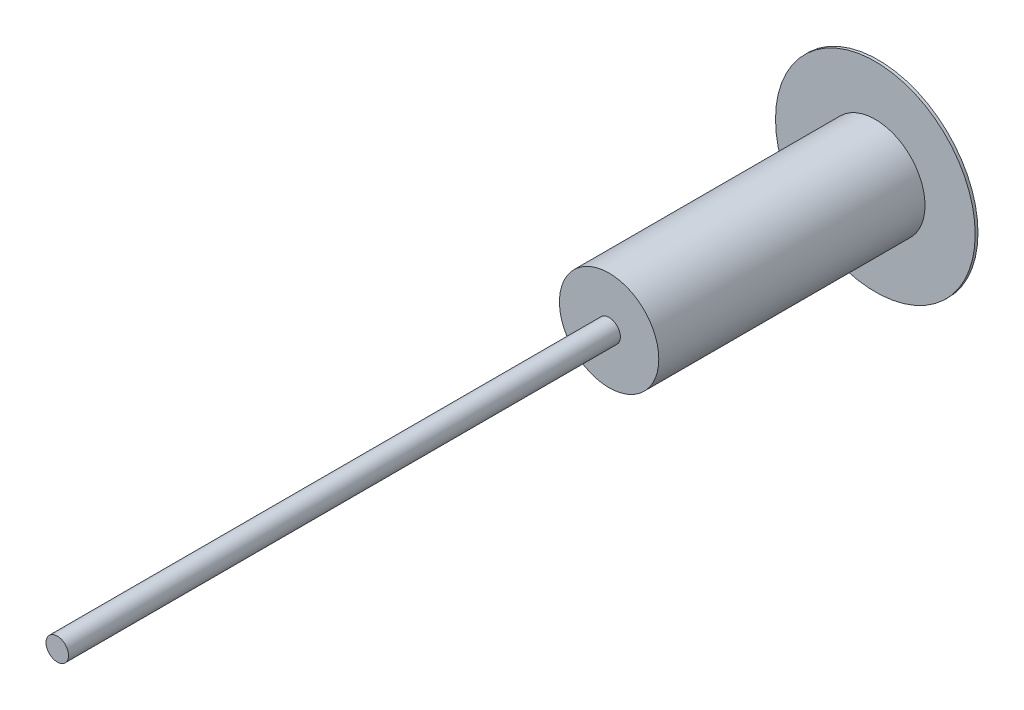
ISO-10303-21;
HEADER;
FILE_DESCRIPTION(('STEP AP214'),'2;1');
FILE_NAME('part.step','',(''),(''),'','','');
FILE_SCHEMA(('AUTOMOTIVE_DESIGN { 1 0 10303 214 1 1 1 1 }'));
ENDSEC;
DATA;
#1=APPLICATION_CONTEXT('core data for automotive mechanical design processes');
#2=APPLICATION_PROTOCOL_DEFINITION('international standard','automotive_design',2000,#1);
#3=PRODUCT_CONTEXT('',#1,'mechanical');
#4=PRODUCT('Part','Part','',(#3));
#5=PRODUCT_RELATED_PRODUCT_CATEGORY('part','',(#4));
#6=PRODUCT_DEFINITION_FORMATION('','',#4);
#7=PRODUCT_DEFINITION_CONTEXT('part definition',#1,'design');
#8=PRODUCT_DEFINITION('design','',#6,#7);
#9=PRODUCT_DEFINITION_SHAPE('','',#8);
#10=(LENGTH_UNIT() NAMED_UNIT(*) SI_UNIT(.MILLI.,.METRE.));
#11=(NAMED_UNIT(*) PLANE_ANGLE_UNIT() SI_UNIT($,.RADIAN.));
#12=(NAMED_UNIT(*) SI_UNIT($,.STERADIAN.) SOLID_ANGLE_UNIT());
#13=UNCERTAINTY_MEASURE_WITH_UNIT(LENGTH_MEASURE(1.E-05),#10,'distance_accuracy_value','');
#14=(GEOMETRIC_REPRESENTATION_CONTEXT(3) GLOBAL_UNCERTAINTY_ASSIGNED_CONTEXT((#13)) GLOBAL_UNIT_ASSIGNED_CONTEXT((#10,
#11,#12)) REPRESENTATION_CONTEXT('',''));
#15=CARTESIAN_POINT('',(0.,0.,0.));
#16=DIRECTION('',(0.,0.,1.));
#17=DIRECTION('',(1.,0.,0.));
#18=AXIS2_PLACEMENT_3D('',#15,#16,#17);
#19=CARTESIAN_POINT('',(0.,0.,-2037.3));
#20=DIRECTION('',(0.,0.,-1.));
#21=DIRECTION('',(-1.,0.,0.));
#22=AXIS2_PLACEMENT_3D('',#19,#20,#21);
#23=CYLINDRICAL_SURFACE('',#22,450.);
#24=CARTESIAN_POINT('',(0.,0.,-2037.3));
#25=DIRECTION('',(0.,0.,1.));
#26=DIRECTION('',(1.,0.,0.));
#27=AXIS2_PLACEMENT_3D('',#24,#25,#26);
#28=CIRCLE('',#27,450.);
#29=CARTESIAN_POINT('',(450.,0.,-2037.3));
#30=VERTEX_POINT('',#29);
#31=EDGE_CURVE('E44',#30,#30,#28,.T.);
#32=ORIENTED_EDGE('',*,*,#31,.F.);
#33=EDGE_LOOP('',(#32));
#34=FACE_BOUND('',#33,.T.);
#35=CARTESIAN_POINT('',(0.,0.,-2050.));
#36=DIRECTION('',(0.,0.,1.));
#37=DIRECTION('',(1.,0.,0.));
#38=AXIS2_PLACEMENT_3D('',#35,#36,#37);
#39=CIRCLE('',#38,450.);
#40=CARTESIAN_POINT('',(450.,0.,-2050.));
#41=VERTEX_POINT('',#40);
#42=EDGE_CURVE('E48',#41,#41,#39,.T.);
#43=ORIENTED_EDGE('',*,*,#42,.T.);
#44=EDGE_LOOP('',(#43));
#45=FACE_BOUND('',#44,.T.);
#46=ADVANCED_FACE('F36',(#34,#45),#23,.T.);
#47=CARTESIAN_POINT('',(0.,0.,-2037.3));
#48=DIRECTION('',(0.,0.,1.));
#49=DIRECTION('',(1.,0.,0.));
#50=AXIS2_PLACEMENT_3D('',#47,#48,#49);
#51=PLANE('',#50);
#52=CARTESIAN_POINT('',(0.,0.,-2037.3));
#53=DIRECTION('',(0.,0.,1.));
#54=DIRECTION('',(1.,0.,0.));
#55=AXIS2_PLACEMENT_3D('',#52,#53,#54);
#56=CIRCLE('',#55,223.901);
#57=CARTESIAN_POINT('',(223.901,0.,-2037.3));
#58=VERTEX_POINT('',#57);
#59=EDGE_CURVE('E53',#58,#58,#56,.T.);
#60=ORIENTED_EDGE('',*,*,#59,.F.);
#61=EDGE_LOOP('',(#60));
#62=FACE_BOUND('',#61,.T.);
#63=ORIENTED_EDGE('',*,*,#31,.T.);
#64=EDGE_LOOP('',(#63));
#65=FACE_BOUND('',#64,.T.);
#66=ADVANCED_FACE('F78',(#62,#65),#51,.T.);
#67=CARTESIAN_POINT('',(0.,0.,-2050.));
#68=DIRECTION('',(0.,0.,1.));
#69=DIRECTION('',(1.,0.,0.));
#70=AXIS2_PLACEMENT_3D('',#67,#68,#69);
#71=PLANE('',#70);
#72=ORIENTED_EDGE('',*,*,#42,.F.);
#73=EDGE_LOOP('',(#72));
#74=FACE_BOUND('',#73,.T.);
#75=ADVANCED_FACE('F74',(#74),#71,.F.);
#76=CARTESIAN_POINT('',(0.,0.,-837.3));
#77=DIRECTION('',(0.,0.,-1.));
#78=DIRECTION('',(-1.,0.,0.));
#79=AXIS2_PLACEMENT_3D('',#76,#77,#78);
#80=CYLINDRICAL_SURFACE('',#79,223.901);
#81=CARTESIAN_POINT('',(0.,0.,-837.3));
#82=DIRECTION('',(0.,0.,1.));
#83=DIRECTION('',(1.,0.,0.));
#84=AXIS2_PLACEMENT_3D('',#81,#82,#83);
#85=CIRCLE('',#84,223.901);
#86=CARTESIAN_POINT('',(223.901,0.,-837.3));
#87=VERTEX_POINT('',#86);
#88=EDGE_CURVE('E56',#87,#87,#85,.T.);
#89=ORIENTED_EDGE('',*,*,#88,.F.);
#90=EDGE_LOOP('',(#89));
#91=FACE_BOUND('',#90,.T.);
#92=ORIENTED_EDGE('',*,*,#59,.T.);
#93=EDGE_LOOP('',(#92));
#94=FACE_BOUND('',#93,.T.);
#95=ADVANCED_FACE('F68',(#91,#94),#80,.T.);
#96=CARTESIAN_POINT('',(0.,0.,-837.3));
#97=DIRECTION('',(0.,0.,1.));
#98=DIRECTION('',(1.,0.,0.));
#99=AXIS2_PLACEMENT_3D('',#96,#97,#98);
#100=PLANE('',#99);
#101=CARTESIAN_POINT('',(0.,0.,-837.3));
#102=DIRECTION('',(0.,0.,1.));
#103=DIRECTION('',(1.,0.,0.));
#104=AXIS2_PLACEMENT_3D('',#101,#102,#103);
#105=CIRCLE('',#104,50.8);
#106=CARTESIAN_POINT('',(50.8,0.,-837.3));
#107=VERTEX_POINT('',#106);
#108=EDGE_CURVE('E40',#107,#107,#105,.T.);
#109=ORIENTED_EDGE('',*,*,#108,.F.);
#110=EDGE_LOOP('',(#109));
#111=FACE_BOUND('',#110,.T.);
#112=ORIENTED_EDGE('',*,*,#88,.T.);
#113=EDGE_LOOP('',(#112));
#114=FACE_BOUND('',#113,.T.);
#115=ADVANCED_FACE('F65',(#111,#114),#100,.T.);
#116=CARTESIAN_POINT('',(0.,0.,1650.));
#117=DIRECTION('',(0.,0.,1.));
#118=DIRECTION('',(1.,0.,0.));
#119=AXIS2_PLACEMENT_3D('',#116,#117,#118);
#120=PLANE('',#119);
#121=CARTESIAN_POINT('',(0.,0.,1650.));
#122=DIRECTION('',(0.,0.,1.));
#123=DIRECTION('',(1.,0.,0.));
#124=AXIS2_PLACEMENT_3D('',#121,#122,#123);
#125=CIRCLE('',#124,50.8);
#126=CARTESIAN_POINT('',(50.8,0.,1650.));
#127=VERTEX_POINT('',#126);
#128=EDGE_CURVE('E10',#127,#127,#125,.T.);
#129=ORIENTED_EDGE('',*,*,#128,.T.);
#130=EDGE_LOOP('',(#129));
#131=FACE_BOUND('',#130,.T.);
#132=ADVANCED_FACE('F67',(#131),#120,.T.);
#133=CARTESIAN_POINT('',(0.,0.,1650.));
#134=DIRECTION('',(0.,0.,-1.));
#135=DIRECTION('',(-1.,0.,0.));
#136=AXIS2_PLACEMENT_3D('',#133,#134,#135);
#137=CYLINDRICAL_SURFACE('',#136,50.8);
#138=ORIENTED_EDGE('',*,*,#108,.T.);
#139=EDGE_LOOP('',(#138));
#140=FACE_BOUND('',#139,.T.);
#141=ORIENTED_EDGE('',*,*,#128,.F.);
#142=EDGE_LOOP('',(#141));
#143=FACE_BOUND('',#142,.T.);
#144=ADVANCED_FACE('F38',(#140,#143),#137,.T.);
#145=CLOSED_SHELL('',(#46,#66,#75,#95,#115,#132,#144));
#146=MANIFOLD_SOLID_BREP('B2',#145);
#147=ADVANCED_BREP_SHAPE_REPRESENTATION('',(#18,#146),#14);
#148=SHAPE_DEFINITION_REPRESENTATION(#9,#147);
ENDSEC;
END-ISO-10303-21;
